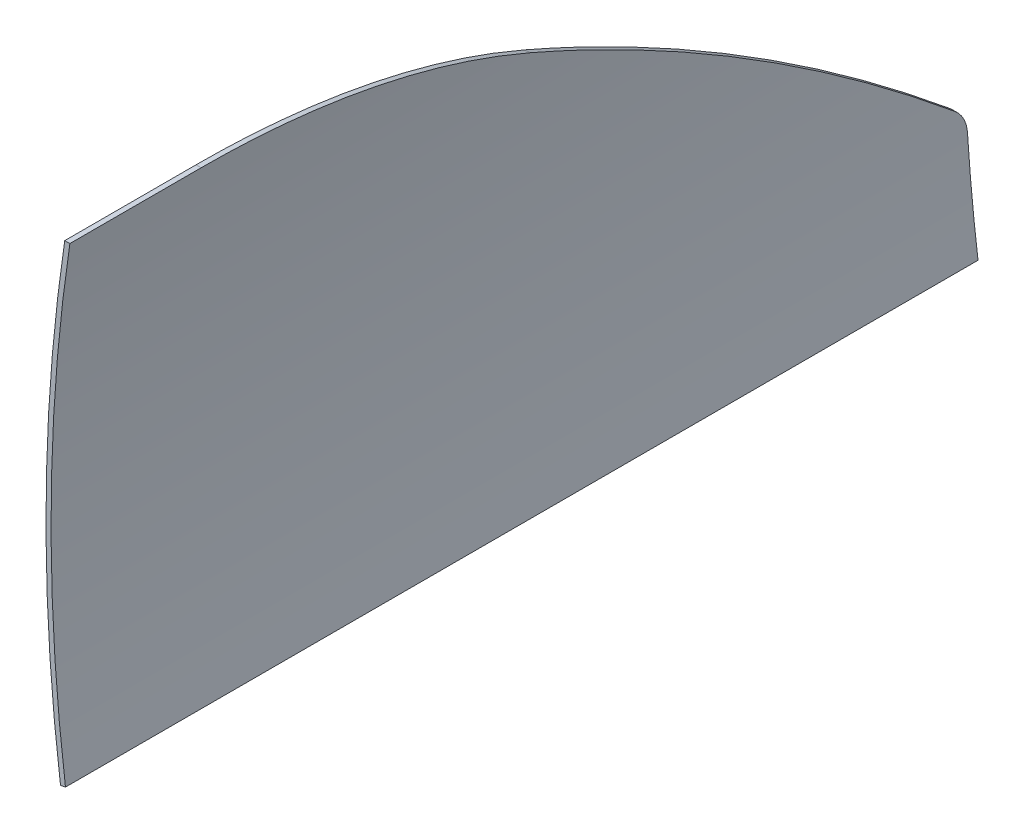
ISO-10303-21;
HEADER;
FILE_DESCRIPTION(('STEP AP214'),'2;1');
FILE_NAME('part.step','',(''),(''),'','','');
FILE_SCHEMA(('AUTOMOTIVE_DESIGN { 1 0 10303 214 1 1 1 1 }'));
ENDSEC;
DATA;
#1=APPLICATION_CONTEXT('core data for automotive mechanical design processes');
#2=APPLICATION_PROTOCOL_DEFINITION('international standard','automotive_design',2000,#1);
#3=PRODUCT_CONTEXT('',#1,'mechanical');
#4=PRODUCT('Part','Part','',(#3));
#5=PRODUCT_RELATED_PRODUCT_CATEGORY('part','',(#4));
#6=PRODUCT_DEFINITION_FORMATION('','',#4);
#7=PRODUCT_DEFINITION_CONTEXT('part definition',#1,'design');
#8=PRODUCT_DEFINITION('design','',#6,#7);
#9=PRODUCT_DEFINITION_SHAPE('','',#8);
#10=(LENGTH_UNIT() NAMED_UNIT(*) SI_UNIT(.MILLI.,.METRE.));
#11=(NAMED_UNIT(*) PLANE_ANGLE_UNIT() SI_UNIT($,.RADIAN.));
#12=(NAMED_UNIT(*) SI_UNIT($,.STERADIAN.) SOLID_ANGLE_UNIT());
#13=UNCERTAINTY_MEASURE_WITH_UNIT(LENGTH_MEASURE(1.E-05),#10,'distance_accuracy_value','');
#14=(GEOMETRIC_REPRESENTATION_CONTEXT(3) GLOBAL_UNCERTAINTY_ASSIGNED_CONTEXT((#13)) GLOBAL_UNIT_ASSIGNED_CONTEXT((#10,
#11,#12)) REPRESENTATION_CONTEXT('',''));
#15=CARTESIAN_POINT('',(0.,0.,0.));
#16=DIRECTION('',(0.,0.,1.));
#17=DIRECTION('',(1.,0.,0.));
#18=AXIS2_PLACEMENT_3D('',#15,#16,#17);
#19=CARTESIAN_POINT('',(1662.91267359414,250.,308.));
#20=DIRECTION('',(0.,0.,1.));
#21=DIRECTION('',(-1.,0.,0.));
#22=AXIS2_PLACEMENT_3D('',#19,#20,#21);
#23=CYLINDRICAL_SURFACE('',#22,1679.1);
#24=CARTESIAN_POINT('',(1662.91267359414,250.,404.));
#25=DIRECTION('',(0.,0.,1.));
#26=DIRECTION('',(1.,0.,0.));
#27=AXIS2_PLACEMENT_3D('',#24,#25,#26);
#28=CIRCLE('',#27,1679.1);
#29=CARTESIAN_POINT('',(-1.85821629717053,31.1057466023691,404.));
#30=VERTEX_POINT('',#29);
#31=CARTESIAN_POINT('',(-12.2574940213667,135.188330161751,404.));
#32=VERTEX_POINT('',#31);
#33=EDGE_CURVE('E124',#30,#32,#28,.F.);
#34=ORIENTED_EDGE('',*,*,#33,.T.);
#35=CARTESIAN_POINT('',(-12.2574940213667,135.188330161751,404.));
#36=CARTESIAN_POINT('',(-12.2864303509859,135.610524856966,403.999999538775));
#37=CARTESIAN_POINT('',(-12.3152033484983,136.032683792228,404.008913477108));
#38=CARTESIAN_POINT('',(-12.3723795026291,136.876264779503,404.044547705152));
#39=CARTESIAN_POINT('',(-12.4007826677193,137.297686848203,404.071267586249));
#40=CARTESIAN_POINT('',(-12.4853616680688,138.559685367766,404.178086712017));
#41=CARTESIAN_POINT('',(-12.5409203534523,139.398188875581,404.28484546129));
#42=CARTESIAN_POINT('',(-12.6499925060041,141.063056240984,404.568716356648));
#43=CARTESIAN_POINT('',(-12.7035066300835,141.88942394433,404.745805693771));
#44=CARTESIAN_POINT('',(-12.7820081314885,143.115428253876,405.063181768486));
#45=CARTESIAN_POINT('',(-12.8078810880648,143.521850268377,405.177601608815));
#46=CARTESIAN_POINT('',(-12.8590142278855,144.329644118176,405.423529286639));
#47=CARTESIAN_POINT('',(-12.8842742524691,144.731014633194,405.55504149375));
#48=CARTESIAN_POINT('',(-12.9591045688719,145.926800879809,405.975026753511));
#49=CARTESIAN_POINT('',(-13.0077016081075,146.712524044109,406.288853342524));
#50=CARTESIAN_POINT('',(-13.1020404921137,148.254802470497,406.981820549094));
#51=CARTESIAN_POINT('',(-13.1477823222455,149.011357583031,407.360961501482));
#52=CARTESIAN_POINT('',(-13.214080157634,150.119809342587,407.976366585649));
#53=CARTESIAN_POINT('',(-13.2357877410823,150.484795843403,408.189216356547));
#54=CARTESIAN_POINT('',(-13.278414448833,151.205381719958,408.630087692131));
#55=CARTESIAN_POINT('',(-13.2993337916973,151.560983689508,408.858105001969));
#56=CARTESIAN_POINT('',(-13.3608843173413,152.61282487253,409.56437490661));
#57=CARTESIAN_POINT('',(-13.4003237306305,153.294362851921,410.064991794749));
#58=CARTESIAN_POINT('',(-13.4615129469372,154.362325531576,410.92115984097));
#59=CARTESIAN_POINT('',(-13.4842945370347,154.762566032009,411.259638658816));
#60=CARTESIAN_POINT('',(-13.5285512291079,155.544809266365,411.957127853397));
#61=CARTESIAN_POINT('',(-13.5500264614183,155.926813818856,412.316136174958));
#62=CARTESIAN_POINT('',(-13.5916281455417,156.671145444289,413.053335841709));
#63=CARTESIAN_POINT('',(-13.6117559204717,157.033491752044,413.431507708688));
#64=CARTESIAN_POINT('',(-13.6506747354486,157.738016724901,414.206412841287));
#65=CARTESIAN_POINT('',(-13.6694654753302,158.080190858401,414.603150241946));
#66=CARTESIAN_POINT('',(-13.6875775153225,158.411747589012,415.008610293105));
#67=B_SPLINE_CURVE_WITH_KNOTS('',3,(#35,#36,#37,#38,#39,#40,#41,#42,#43,#44,#45,#46,#47,#48,#49,
#50,#51,#52,#53,#54,#55,#56,#57,#58,#59,#60,#61,#62,#63,#64,#65,#66),.UNSPECIFIED.,.F.,.F.,(4,2,
2,2,2,2,2,2,2,2,2,2,2,2,2,4),(0.,1.26936796567069,2.53870680251005,5.07680077410025,
7.61407228599208,8.88278287242378,10.1518184415712,12.691026200315,15.2302469765906,
16.4991318934745,17.7676623476523,20.3038206508079,21.8772282234228,23.4504785596796,
25.0221606911958,26.5941945601457),.UNSPECIFIED.);
#68=CARTESIAN_POINT('',(-13.6875775153225,158.411747589012,415.008610293105));
#69=VERTEX_POINT('',#68);
#70=EDGE_CURVE('E126',#32,#69,#67,.T.);
#71=ORIENTED_EDGE('',*,*,#70,.T.);
#72=CARTESIAN_POINT('',(-13.6875775153225,158.411747589012,415.008610293105));
#73=CARTESIAN_POINT('',(-14.0526604980433,165.095014728516,423.181148219991));
#74=CARTESIAN_POINT('',(-14.3741894513233,171.714468700817,431.407747595827));
#75=CARTESIAN_POINT('',(-14.9347228152785,184.82354667566,447.966416379743));
#76=CARTESIAN_POINT('',(-15.1737279246748,191.313171777012,456.298484894205));
#77=CARTESIAN_POINT('',(-15.5737914896638,204.160127369066,473.065089132358));
#78=CARTESIAN_POINT('',(-15.7348544857563,210.51746554546,481.499618857843));
#79=CARTESIAN_POINT('',(-15.9835965028871,223.098173918881,498.468951186167));
#80=CARTESIAN_POINT('',(-16.0712753699186,229.32154383473,507.003753999405));
#81=CARTESIAN_POINT('',(-16.2305403339362,247.734216196206,532.680007252465));
#82=CARTESIAN_POINT('',(-16.2000296183187,259.722524737031,549.966977710933));
#83=CARTESIAN_POINT('',(-15.9009872164411,283.146739309586,584.908826626485));
#84=CARTESIAN_POINT('',(-15.6324524413265,294.582638170626,602.563709855094));
#85=CARTESIAN_POINT('',(-14.8915988909184,316.889129816982,638.2208505364));
#86=CARTESIAN_POINT('',(-14.4192959396728,327.759766425494,656.223080911441));
#87=CARTESIAN_POINT('',(-13.3041349428485,348.925923713831,692.557742767511));
#88=CARTESIAN_POINT('',(-12.6612763550171,359.221442565041,710.890175298189));
#89=CARTESIAN_POINT('',(-11.5916576630007,374.247366502559,738.662078362301));
#90=CARTESIAN_POINT('',(-11.2166229949857,379.196852325935,747.985692768009));
#91=CARTESIAN_POINT('',(-10.4355944865959,388.947127714602,766.709190839875));
#92=CARTESIAN_POINT('',(-10.02960061899,393.747917149098,776.109074573111));
#93=CARTESIAN_POINT('',(-9.19056339639171,403.199499034462,794.982465920167));
#94=CARTESIAN_POINT('',(-8.7575206256569,407.850294721913,804.455971939874));
#95=CARTESIAN_POINT('',(-7.86816742590297,417.000928185204,823.474496926653));
#96=CARTESIAN_POINT('',(-7.41185706230229,421.500766385411,833.019515692597));
#97=CARTESIAN_POINT('',(-6.94580652841649,425.92460419963,842.599161720348));
#98=B_SPLINE_CURVE_WITH_KNOTS('',3,(#72,#73,#74,#75,#76,#77,#78,#79,#80,#81,#82,#83,#84,#85,#86,
#87,#88,#89,#90,#91,#92,#93,#94,#95,#96,#97),.UNSPECIFIED.,.F.,.F.,(4,2,2,2,2,2,2,2,2,2,2,2,4),
(0.,31.6903050230312,63.3803417208027,95.0685321004801,126.756788982061,189.854971713458,
252.953973286261,316.048075654652,379.142378622431,410.828963890059,442.515577028968,
474.201505972227,505.887345833241),.UNSPECIFIED.);
#99=CARTESIAN_POINT('',(-6.9458065284167,425.92460419963,842.599161720348));
#100=VERTEX_POINT('',#99);
#101=EDGE_CURVE('E180',#69,#100,#98,.T.);
#102=ORIENTED_EDGE('',*,*,#101,.T.);
#103=CARTESIAN_POINT('',(-6.9458065284167,425.92460419963,842.599161720348));
#104=CARTESIAN_POINT('',(-6.69665422505623,428.289455799148,847.720129327968));
#105=CARTESIAN_POINT('',(-6.44814509912682,430.600140181221,852.866129653417));
#106=CARTESIAN_POINT('',(-5.95383995624069,435.112203418949,863.205961136838));
#107=CARTESIAN_POINT('',(-5.70804394052839,437.313582224469,868.399792316747));
#108=CARTESIAN_POINT('',(-5.22058710120033,441.606104214611,878.833151128363));
#109=CARTESIAN_POINT('',(-4.97892636085668,443.697245181133,884.072679677079));
#110=CARTESIAN_POINT('',(-4.5011069586019,447.768281725359,894.594921707438));
#111=CARTESIAN_POINT('',(-4.26494829526287,449.748177331933,899.877635177873));
#112=CARTESIAN_POINT('',(-3.56643098544166,455.521918043394,915.793379311696));
#113=CARTESIAN_POINT('',(-3.11429256666275,459.147536755344,926.488471315989));
#114=CARTESIAN_POINT('',(-2.2471219840007,465.943039964759,948.023356894242));
#115=CARTESIAN_POINT('',(-1.83208912227906,469.112933033668,958.863147742464));
#116=CARTESIAN_POINT('',(-1.0548726973034,474.938422892343,980.47225093206));
#117=CARTESIAN_POINT('',(-0.691871298106507,477.602260730111,991.239311186875));
#118=CARTESIAN_POINT('',(-0.0171953739844431,482.480376850164,1012.87680353208));
#119=CARTESIAN_POINT('',(0.294477429150203,484.694640052288,1023.74723907721));
#120=CARTESIAN_POINT('',(0.860236924533955,488.668247349398,1045.5654994134));
#121=CARTESIAN_POINT('',(1.11435833954759,490.427865838209,1056.51327340947));
#122=CARTESIAN_POINT('',(1.56034320955563,493.490542973513,1078.47282909993));
#123=CARTESIAN_POINT('',(1.75221486004451,494.793661722294,1089.48460217404));
#124=CARTESIAN_POINT('',(1.95738850827555,496.179701213508,1103.72808111964));
#125=CARTESIAN_POINT('',(2.00083869214886,496.472639202832,1106.93982012485));
#126=CARTESIAN_POINT('',(2.08210450724497,497.019652066328,1113.36658008729));
#127=CARTESIAN_POINT('',(2.11992035367996,497.273728424889,1116.58160091444));
#128=CARTESIAN_POINT('',(2.22481135626323,497.977538930866,1126.23002553376));
#129=CARTESIAN_POINT('',(2.28334550971719,498.368959189604,1132.66786725262));
#130=CARTESIAN_POINT('',(2.37749551935759,498.997669252438,1145.58555103175));
#131=CARTESIAN_POINT('',(2.41298766087125,499.234127112253,1152.06543417793));
#132=CARTESIAN_POINT('',(2.46036435475487,499.549479026968,1165.03020086237));
#133=CARTESIAN_POINT('',(2.47224496859776,499.628346795023,1171.5150850544));
#134=CARTESIAN_POINT('',(2.4722179376695,499.628330161751,1178.));
#135=B_SPLINE_CURVE_WITH_KNOTS('',3,(#103,#104,#105,#106,#107,#108,#109,#110,#111,#112,#113,
#114,#115,#116,#117,#118,#119,#120,#121,#122,#123,#124,#125,#126,#127,#128,#129,#130,#131,#132,
#133,#134),.UNSPECIFIED.,.F.,.F.,(4,2,2,2,2,2,2,2,2,2,2,2,2,2,2,4),(0.,16.9380846326701,
33.8761770340211,50.8146101176378,67.7530388053932,101.647878235621,135.542080076646,
168.82527471867,202.109585600496,235.373761075662,268.63355537605,278.309500796286,
287.98507653412,307.332985956469,326.783935297483,346.238128886989),.UNSPECIFIED.);
#136=CARTESIAN_POINT('',(2.4722179376695,499.628330161751,1178.));
#137=VERTEX_POINT('',#136);
#138=EDGE_CURVE('E173',#100,#137,#135,.T.);
#139=ORIENTED_EDGE('',*,*,#138,.T.);
#140=DIRECTION('',(0.,0.,-1.));
#141=VECTOR('',#140,1.);
#142=CARTESIAN_POINT('',(2.4722179376695,499.628330161751,308.));
#143=LINE('',#142,#141);
#144=CARTESIAN_POINT('',(2.4722179376695,499.628330161751,1308.));
#145=VERTEX_POINT('',#144);
#146=EDGE_CURVE('E123',#145,#137,#143,.T.);
#147=ORIENTED_EDGE('',*,*,#146,.F.);
#148=CARTESIAN_POINT('',(1662.91267359414,250.,1308.));
#149=DIRECTION('',(0.,0.,1.));
#150=DIRECTION('',(1.,0.,0.));
#151=AXIS2_PLACEMENT_3D('',#148,#149,#150);
#152=CIRCLE('',#151,1679.1);
#153=CARTESIAN_POINT('',(-1.85821629717053,31.1057466023691,1308.));
#154=VERTEX_POINT('',#153);
#155=EDGE_CURVE('E106',#154,#145,#152,.F.);
#156=ORIENTED_EDGE('',*,*,#155,.F.);
#157=DIRECTION('',(0.,0.,-1.));
#158=VECTOR('',#157,1.);
#159=CARTESIAN_POINT('',(-1.85821629717053,31.1057466023691,1308.));
#160=LINE('',#159,#158);
#161=EDGE_CURVE('E113',#154,#30,#160,.T.);
#162=ORIENTED_EDGE('',*,*,#161,.T.);
#163=EDGE_LOOP('',(#34,#71,#102,#139,#147,#156,#162));
#164=FACE_BOUND('',#163,.T.);
#165=ADVANCED_FACE('F41',(#164),#23,.F.);
#166=CARTESIAN_POINT('',(1662.91267359414,250.,308.));
#167=DIRECTION('',(0.,0.,1.));
#168=DIRECTION('',(-1.,0.,0.));
#169=AXIS2_PLACEMENT_3D('',#166,#167,#168);
#170=CYLINDRICAL_SURFACE('',#169,1684.1);
#171=CARTESIAN_POINT('',(1662.91267359414,250.,1308.));
#172=DIRECTION('',(0.,0.,1.));
#173=DIRECTION('',(1.,0.,0.));
#174=AXIS2_PLACEMENT_3D('',#171,#172,#173);
#175=CIRCLE('',#174,1684.1);
#176=CARTESIAN_POINT('',(-6.7806035687441,30.1883301617507,1308.));
#177=VERTEX_POINT('',#176);
#178=CARTESIAN_POINT('',(-2.58380096852528,499.628330161751,1308.));
#179=VERTEX_POINT('',#178);
#180=EDGE_CURVE('E109',#177,#179,#175,.F.);
#181=ORIENTED_EDGE('',*,*,#180,.T.);
#182=DIRECTION('',(0.,0.,1.));
#183=VECTOR('',#182,1.);
#184=CARTESIAN_POINT('',(-2.58380096852528,499.628330161751,308.));
#185=LINE('',#184,#183);
#186=CARTESIAN_POINT('',(-2.58380096852528,499.628330161751,1178.));
#187=VERTEX_POINT('',#186);
#188=EDGE_CURVE('E208',#187,#179,#185,.T.);
#189=ORIENTED_EDGE('',*,*,#188,.F.);
#190=CARTESIAN_POINT('',(-11.9733952586685,425.92460419963,842.599161720348));
#191=CARTESIAN_POINT('',(-11.7249826032305,428.289534261498,847.720299219285));
#192=CARTESIAN_POINT('',(-11.477211584378,430.600293434025,852.866470957045));
#193=CARTESIAN_POINT('',(-10.9843754167438,435.112498708392,863.206647711423));
#194=CARTESIAN_POINT('',(-10.7393102691941,437.313944760463,868.400652749819));
#195=CARTESIAN_POINT('',(-10.2533037923008,441.606593427659,878.834360951981));
#196=CARTESIAN_POINT('',(-10.01236254583,443.69779382907,884.074065030918));
#197=CARTESIAN_POINT('',(-9.53596673581243,447.768941388827,894.596659439372));
#198=CARTESIAN_POINT('',(-9.30051217084658,449.74888857595,899.879549757718));
#199=CARTESIAN_POINT('',(-8.6040792272163,455.522770683743,915.795821771126));
#200=CARTESIAN_POINT('',(-8.1532921810595,459.148467444129,926.491265955587));
#201=CARTESIAN_POINT('',(-7.2887179889605,465.944095008922,948.026855078916));
#202=CARTESIAN_POINT('',(-6.87493014761872,469.114034379964,958.866997293784));
#203=CARTESIAN_POINT('',(-6.10004964455078,474.939587826747,980.476803767954));
#204=CARTESIAN_POINT('',(-5.73814155831986,477.603443058794,991.24421613666));
#205=CARTESIAN_POINT('',(-5.06550272324403,482.481563524898,1012.88240676481));
#206=CARTESIAN_POINT('',(-4.75477369104536,484.695813678895,1023.75318847854));
#207=CARTESIAN_POINT('',(-4.19073286068251,488.669365699768,1045.57213479535));
#208=CARTESIAN_POINT('',(-3.93738644800712,490.428941927094,1056.52024861739));
#209=CARTESIAN_POINT('',(-3.49276810966322,493.491506162567,1078.48047593508));
#210=CARTESIAN_POINT('',(-3.30148801279038,494.794554275722,1089.49258081167));
#211=CARTESIAN_POINT('',(-3.09695841018485,496.180442680612,1103.73604857412));
#212=CARTESIAN_POINT('',(-3.05364919660776,496.473317983097,1106.94744777212));
#213=CARTESIAN_POINT('',(-2.97264709858215,497.020213703438,1113.37352663182));
#214=CARTESIAN_POINT('',(-2.9349539996391,497.27423560522,1116.58820616351));
#215=CARTESIAN_POINT('',(-2.83040353097442,497.977895146691,1126.2356049378));
#216=CARTESIAN_POINT('',(-2.77205950474492,498.369231288201,1132.67276010737));
#217=CARTESIAN_POINT('',(-2.67821542833253,498.99780573721,1145.58905721958));
#218=CARTESIAN_POINT('',(-2.6428386682791,499.234212433979,1152.06824022177));
#219=CARTESIAN_POINT('',(-2.59561600897564,499.549496096687,1165.0316048023));
#220=CARTESIAN_POINT('',(-2.58377403579578,499.628346779162,1171.51578703415));
#221=CARTESIAN_POINT('',(-2.58380096852547,499.628330161751,1178.));
#222=B_SPLINE_CURVE_WITH_KNOTS('',3,(#190,#191,#192,#193,#194,#195,#196,#197,#198,#199,#200,
#201,#202,#203,#204,#205,#206,#207,#208,#209,#210,#211,#212,#213,#214,#215,#216,#217,#218,#219,
#220,#221),.UNSPECIFIED.,.F.,.F.,(4,2,2,2,2,2,2,2,2,2,2,2,2,2,2,4),(0.,16.9385476788605,
33.8771030698093,50.8159984547609,67.7548894582471,101.650641035824,135.545755409212,
168.82988000149,202.1151207816,235.380229348293,268.640956691687,278.315864314328,
287.990402331422,307.336236441075,326.785080171984,346.237168084292),.UNSPECIFIED.);
#223=CARTESIAN_POINT('',(-11.9733952586685,425.92460419963,842.599161720348));
#224=VERTEX_POINT('',#223);
#225=EDGE_CURVE('E156',#224,#187,#222,.T.);
#226=ORIENTED_EDGE('',*,*,#225,.F.);
#227=CARTESIAN_POINT('',(-18.6950101479129,158.411747589012,415.008610293105));
#228=CARTESIAN_POINT('',(-19.0590059421974,165.095013310755,423.181146564479));
#229=CARTESIAN_POINT('',(-19.3795777885102,171.714460443679,431.4077374467));
#230=CARTESIAN_POINT('',(-19.9384431717419,184.823517383443,447.966379098624));
#231=CARTESIAN_POINT('',(-20.1767374010784,191.313128282503,456.298428980213));
#232=CARTESIAN_POINT('',(-20.5756115570721,204.160053083756,473.064991331561));
#233=CARTESIAN_POINT('',(-20.7361959844722,210.517374627379,481.499497838297));
#234=CARTESIAN_POINT('',(-20.9841993254012,223.09804747527,498.468779020019));
#235=CARTESIAN_POINT('',(-21.0716180863699,229.321398500165,507.00355390404));
#236=CARTESIAN_POINT('',(-21.2304117043605,247.734041780501,532.679758911311));
#237=CARTESIAN_POINT('',(-21.199992881682,259.722338347722,549.966706244056));
#238=CARTESIAN_POINT('',(-20.9018413949271,283.146535568569,584.908516136387));
#239=CARTESIAN_POINT('',(-20.6341056706867,294.582429097039,602.563383437377));
#240=CARTESIAN_POINT('',(-19.8954566431234,316.888927216849,638.220518890473));
#241=CARTESIAN_POINT('',(-19.4245590235788,327.759575371669,656.222760123399));
#242=CARTESIAN_POINT('',(-18.3127183665835,348.925767934324,692.557468168108));
#243=CARTESIAN_POINT('',(-17.6717747907739,359.221310521274,710.889936025203));
#244=CARTESIAN_POINT('',(-16.6053464220672,374.247266325701,738.661890808553));
#245=CARTESIAN_POINT('',(-16.231431467058,379.196756675552,747.985511309847));
#246=CARTESIAN_POINT('',(-15.4527361752717,388.947043965024,766.709027795632));
#247=CARTESIAN_POINT('',(-15.0479558114802,393.7478407745,776.108923846876));
#248=CARTESIAN_POINT('',(-14.2114279958425,403.199440475927,794.98234720523));
#249=CARTESIAN_POINT('',(-13.7796811228182,407.850246584103,804.455872928099));
#250=CARTESIAN_POINT('',(-12.8929911857361,417.000902821171,823.474443173376));
#251=CARTESIAN_POINT('',(-12.4380481865187,421.500753371973,833.019487495804));
#252=CARTESIAN_POINT('',(-11.9733952586683,425.92460419963,842.599161720348));
#253=B_SPLINE_CURVE_WITH_KNOTS('',3,(#227,#228,#229,#230,#231,#232,#233,#234,#235,#236,#237,
#238,#239,#240,#241,#242,#243,#244,#245,#246,#247,#248,#249,#250,#251,#252),.UNSPECIFIED.,.F.,
.F.,(4,2,2,2,2,2,2,2,2,2,2,2,4),(0.,31.6901868330339,63.3801069668416,95.0681914859438,
126.75634207878,189.854457238723,252.953386050714,316.047444596156,379.141702897296,
410.828191784113,442.514708404305,474.200545123689,505.886293276134),.UNSPECIFIED.);
#254=CARTESIAN_POINT('',(-18.6950101479129,158.411747589012,415.008610293105));
#255=VERTEX_POINT('',#254);
#256=EDGE_CURVE('E138',#255,#224,#253,.T.);
#257=ORIENTED_EDGE('',*,*,#256,.F.);
#258=CARTESIAN_POINT('',(-17.2691887258185,135.188330161751,404.));
#259=CARTESIAN_POINT('',(-17.2980386030764,135.610522804638,403.999999538457));
#260=CARTESIAN_POINT('',(-17.326725636894,136.03267962108,404.008913390481));
#261=CARTESIAN_POINT('',(-17.3837309692695,136.876256231334,404.044547254486));
#262=CARTESIAN_POINT('',(-17.4120492762759,137.29767604184,404.071266857762));
#263=CARTESIAN_POINT('',(-17.4963755833222,138.559667528155,404.178084829926));
#264=CARTESIAN_POINT('',(-17.5517682778365,139.398166049207,404.284842383296));
#265=CARTESIAN_POINT('',(-17.6605145245861,141.063022378518,404.568709769109));
#266=CARTESIAN_POINT('',(-17.7138687330068,141.889384039979,404.745796749863));
#267=CARTESIAN_POINT('',(-17.7921356511594,143.115378964162,405.063168315446));
#268=CARTESIAN_POINT('',(-17.8179312930374,143.521797799806,405.177586491451));
#269=CARTESIAN_POINT('',(-17.8689116354754,144.329585197265,405.423510492081));
#270=CARTESIAN_POINT('',(-17.8940961778524,144.730952438805,405.555020686145));
#271=CARTESIAN_POINT('',(-17.9687028733519,145.926728516122,405.974999265501));
#272=CARTESIAN_POINT('',(-18.0171546853825,146.712444682599,406.288820610381));
#273=CARTESIAN_POINT('',(-18.1112116625723,148.254709070757,406.981775657472));
#274=CARTESIAN_POINT('',(-18.156816813109,149.011257142603,407.360909695137));
#275=CARTESIAN_POINT('',(-18.2229165717523,150.119698636821,407.97630314448));
#276=CARTESIAN_POINT('',(-18.244559307479,150.484681820997,408.189148864867));
#277=CARTESIAN_POINT('',(-18.2870586826039,151.205261155659,408.630011659053));
#278=CARTESIAN_POINT('',(-18.3079155399106,151.560859899949,408.858024478095));
#279=CARTESIAN_POINT('',(-18.3692822301282,152.612691620429,409.564280249447));
#280=CARTESIAN_POINT('',(-18.4086038662512,153.294223547496,410.06488681713));
#281=CARTESIAN_POINT('',(-18.4696114301195,154.362195266067,410.921051249413));
#282=CARTESIAN_POINT('',(-18.4923259913739,154.762449818049,411.259538260747));
#283=CARTESIAN_POINT('',(-18.5364524316386,155.544719903156,411.957044950601));
#284=CARTESIAN_POINT('',(-18.5578644405954,155.926737254858,412.316062573969));
#285=CARTESIAN_POINT('',(-18.5993436052094,156.671093090346,413.053281762681));
#286=CARTESIAN_POINT('',(-18.6194120803726,157.033450813814,413.431463845211));
#287=CARTESIAN_POINT('',(-18.658216192609,157.737997273491,414.206390281407));
#288=CARTESIAN_POINT('',(-18.6769515304191,158.080181478202,414.60313876994));
#289=CARTESIAN_POINT('',(-18.695010147913,158.411747589012,415.008610293105));
#290=B_SPLINE_CURVE_WITH_KNOTS('',3,(#258,#259,#260,#261,#262,#263,#264,#265,#266,#267,#268,
#269,#270,#271,#272,#273,#274,#275,#276,#277,#278,#279,#280,#281,#282,#283,#284,#285,#286,#287,
#288,#289),.UNSPECIFIED.,.F.,.F.,(4,2,2,2,2,2,2,2,2,2,2,2,2,2,2,4),(0.,1.2693441151616,
2.53865909538991,5.07670522118874,7.61392734975939,8.88261326498726,10.1516241498798,
12.6907817628197,15.2299524175547,16.4988126838984,17.7673184917156,20.3034276082294,
21.8768744158895,23.4501639934886,25.02188503638,26.5939577940011),.UNSPECIFIED.);
#291=CARTESIAN_POINT('',(-17.2691887258185,135.188330161751,404.));
#292=VERTEX_POINT('',#291);
#293=EDGE_CURVE('E50',#292,#255,#290,.T.);
#294=ORIENTED_EDGE('',*,*,#293,.F.);
#295=CARTESIAN_POINT('',(1662.91267359414,250.,404.));
#296=DIRECTION('',(0.,0.,1.));
#297=DIRECTION('',(1.,0.,0.));
#298=AXIS2_PLACEMENT_3D('',#295,#296,#297);
#299=CIRCLE('',#298,1684.1);
#300=CARTESIAN_POINT('',(-6.7806035687441,30.1883301617507,404.));
#301=VERTEX_POINT('',#300);
#302=EDGE_CURVE('E11',#301,#292,#299,.F.);
#303=ORIENTED_EDGE('',*,*,#302,.F.);
#304=DIRECTION('',(0.,0.,1.));
#305=VECTOR('',#304,1.);
#306=CARTESIAN_POINT('',(-6.7806035687441,30.1883301617507,308.));
#307=LINE('',#306,#305);
#308=EDGE_CURVE('E181',#177,#301,#307,.F.);
#309=ORIENTED_EDGE('',*,*,#308,.F.);
#310=EDGE_LOOP('',(#181,#189,#226,#257,#294,#303,#309));
#311=FACE_BOUND('',#310,.T.);
#312=ADVANCED_FACE('F148',(#311),#170,.T.);
#313=CARTESIAN_POINT('',(1662.91267359414,250.,1308.));
#314=DIRECTION('',(0.,0.,-1.));
#315=DIRECTION('',(1.,0.,0.));
#316=AXIS2_PLACEMENT_3D('',#313,#314,#315);
#317=PLANE('',#316);
#318=ORIENTED_EDGE('',*,*,#155,.T.);
#319=DIRECTION('',(-1.,0.,0.));
#320=VECTOR('',#319,1.);
#321=CARTESIAN_POINT('',(1662.91267359414,499.628330161751,1308.));
#322=LINE('',#321,#320);
#323=EDGE_CURVE('E58',#145,#179,#322,.T.);
#324=ORIENTED_EDGE('',*,*,#323,.T.);
#325=ORIENTED_EDGE('',*,*,#180,.F.);
#326=DIRECTION('',(-0.983071696061995,-0.183221288069353,0.));
#327=VECTOR('',#326,1.);
#328=CARTESIAN_POINT('',(-6.7806035687441,30.1883301617507,1308.));
#329=LINE('',#328,#327);
#330=EDGE_CURVE('E102',#154,#177,#329,.T.);
#331=ORIENTED_EDGE('',*,*,#330,.F.);
#332=EDGE_LOOP('',(#318,#324,#325,#331));
#333=FACE_BOUND('',#332,.T.);
#334=ADVANCED_FACE('F104',(#333),#317,.F.);
#335=CARTESIAN_POINT('',(-40.,30.1883301617507,404.));
#336=DIRECTION('',(0.,0.,-1.));
#337=DIRECTION('',(1.,0.,0.));
#338=AXIS2_PLACEMENT_3D('',#335,#336,#337);
#339=PLANE('',#338);
#340=DIRECTION('',(-0.983071696061995,-0.183221288069353,0.));
#341=VECTOR('',#340,1.);
#342=CARTESIAN_POINT('',(-6.7806035687441,30.1883301617507,404.));
#343=LINE('',#342,#341);
#344=EDGE_CURVE('E114',#30,#301,#343,.T.);
#345=ORIENTED_EDGE('',*,*,#344,.T.);
#346=ORIENTED_EDGE('',*,*,#302,.T.);
#347=DIRECTION('',(1.,0.,0.));
#348=VECTOR('',#347,1.);
#349=CARTESIAN_POINT('',(-40.,135.188330161751,404.));
#350=LINE('',#349,#348);
#351=EDGE_CURVE('E65',#292,#32,#350,.T.);
#352=ORIENTED_EDGE('',*,*,#351,.T.);
#353=ORIENTED_EDGE('',*,*,#33,.F.);
#354=EDGE_LOOP('',(#345,#346,#352,#353));
#355=FACE_BOUND('',#354,.T.);
#356=ADVANCED_FACE('F218',(#355),#339,.T.);
#357=CARTESIAN_POINT('',(-40.,135.188330161751,434.));
#358=DIRECTION('',(1.,0.,0.));
#359=DIRECTION('',(0.,0.,1.));
#360=AXIS2_PLACEMENT_3D('',#357,#358,#359);
#361=CYLINDRICAL_SURFACE('',#360,29.9999999999999);
#362=ORIENTED_EDGE('',*,*,#70,.F.);
#363=ORIENTED_EDGE('',*,*,#351,.F.);
#364=ORIENTED_EDGE('',*,*,#293,.T.);
#365=DIRECTION('',(1.,0.,0.));
#366=VECTOR('',#365,1.);
#367=CARTESIAN_POINT('',(-40.,158.411747589012,415.008610293105));
#368=LINE('',#367,#366);
#369=EDGE_CURVE('E196',#255,#69,#368,.T.);
#370=ORIENTED_EDGE('',*,*,#369,.T.);
#371=EDGE_LOOP('',(#362,#363,#364,#370));
#372=FACE_BOUND('',#371,.T.);
#373=ADVANCED_FACE('F145',(#372),#361,.T.);
#374=CARTESIAN_POINT('',(-40.,-1389.81608089507,1681.10125741948));
#375=DIRECTION('',(1.,0.,0.));
#376=DIRECTION('',(0.,0.,1.));
#377=AXIS2_PLACEMENT_3D('',#374,#375,#376);
#378=CYLINDRICAL_SURFACE('',#377,2000.);
#379=ORIENTED_EDGE('',*,*,#101,.F.);
#380=ORIENTED_EDGE('',*,*,#369,.F.);
#381=ORIENTED_EDGE('',*,*,#256,.T.);
#382=DIRECTION('',(1.,0.,0.));
#383=VECTOR('',#382,1.);
#384=CARTESIAN_POINT('',(-40.,425.92460419963,842.599161720348));
#385=LINE('',#384,#383);
#386=EDGE_CURVE('E201',#224,#100,#385,.T.);
#387=ORIENTED_EDGE('',*,*,#386,.T.);
#388=EDGE_LOOP('',(#379,#380,#381,#387));
#389=FACE_BOUND('',#388,.T.);
#390=ADVANCED_FACE('F168',(#389),#378,.T.);
#391=CARTESIAN_POINT('',(-40.,-300.371669838249,1178.));
#392=DIRECTION('',(1.,0.,0.));
#393=DIRECTION('',(0.,0.,1.));
#394=AXIS2_PLACEMENT_3D('',#391,#392,#393);
#395=CYLINDRICAL_SURFACE('',#394,800.);
#396=ORIENTED_EDGE('',*,*,#138,.F.);
#397=ORIENTED_EDGE('',*,*,#386,.F.);
#398=ORIENTED_EDGE('',*,*,#225,.T.);
#399=DIRECTION('',(1.,0.,0.));
#400=VECTOR('',#399,1.);
#401=CARTESIAN_POINT('',(-40.,499.628330161751,1178.));
#402=LINE('',#401,#400);
#403=EDGE_CURVE('E120',#187,#137,#402,.T.);
#404=ORIENTED_EDGE('',*,*,#403,.T.);
#405=EDGE_LOOP('',(#396,#397,#398,#404));
#406=FACE_BOUND('',#405,.T.);
#407=ADVANCED_FACE('F164',(#406),#395,.T.);
#408=CARTESIAN_POINT('',(-40.,499.628330161751,1308.));
#409=DIRECTION('',(0.,1.,0.));
#410=DIRECTION('',(0.,0.,-1.));
#411=AXIS2_PLACEMENT_3D('',#408,#409,#410);
#412=PLANE('',#411);
#413=ORIENTED_EDGE('',*,*,#323,.F.);
#414=ORIENTED_EDGE('',*,*,#146,.T.);
#415=ORIENTED_EDGE('',*,*,#403,.F.);
#416=ORIENTED_EDGE('',*,*,#188,.T.);
#417=EDGE_LOOP('',(#413,#414,#415,#416));
#418=FACE_BOUND('',#417,.T.);
#419=ADVANCED_FACE('F167',(#418),#412,.T.);
#420=CARTESIAN_POINT('',(-6.7806035687441,30.1883301617507,1308.));
#421=DIRECTION('',(-0.183221288069353,0.983071696061995,0.));
#422=DIRECTION('',(-0.983071696061995,-0.183221288069353,0.));
#423=AXIS2_PLACEMENT_3D('',#420,#421,#422);
#424=PLANE('',#423);
#425=ORIENTED_EDGE('',*,*,#344,.F.);
#426=ORIENTED_EDGE('',*,*,#161,.F.);
#427=ORIENTED_EDGE('',*,*,#330,.T.);
#428=ORIENTED_EDGE('',*,*,#308,.T.);
#429=EDGE_LOOP('',(#425,#426,#427,#428));
#430=FACE_BOUND('',#429,.T.);
#431=ADVANCED_FACE('F117',(#430),#424,.F.);
#432=CLOSED_SHELL('',(#165,#312,#334,#356,#373,#390,#407,#419,#431));
#433=MANIFOLD_SOLID_BREP('B2',#432);
#434=ADVANCED_BREP_SHAPE_REPRESENTATION('',(#18,#433),#14);
#435=SHAPE_DEFINITION_REPRESENTATION(#9,#434);
ENDSEC;
END-ISO-10303-21;
